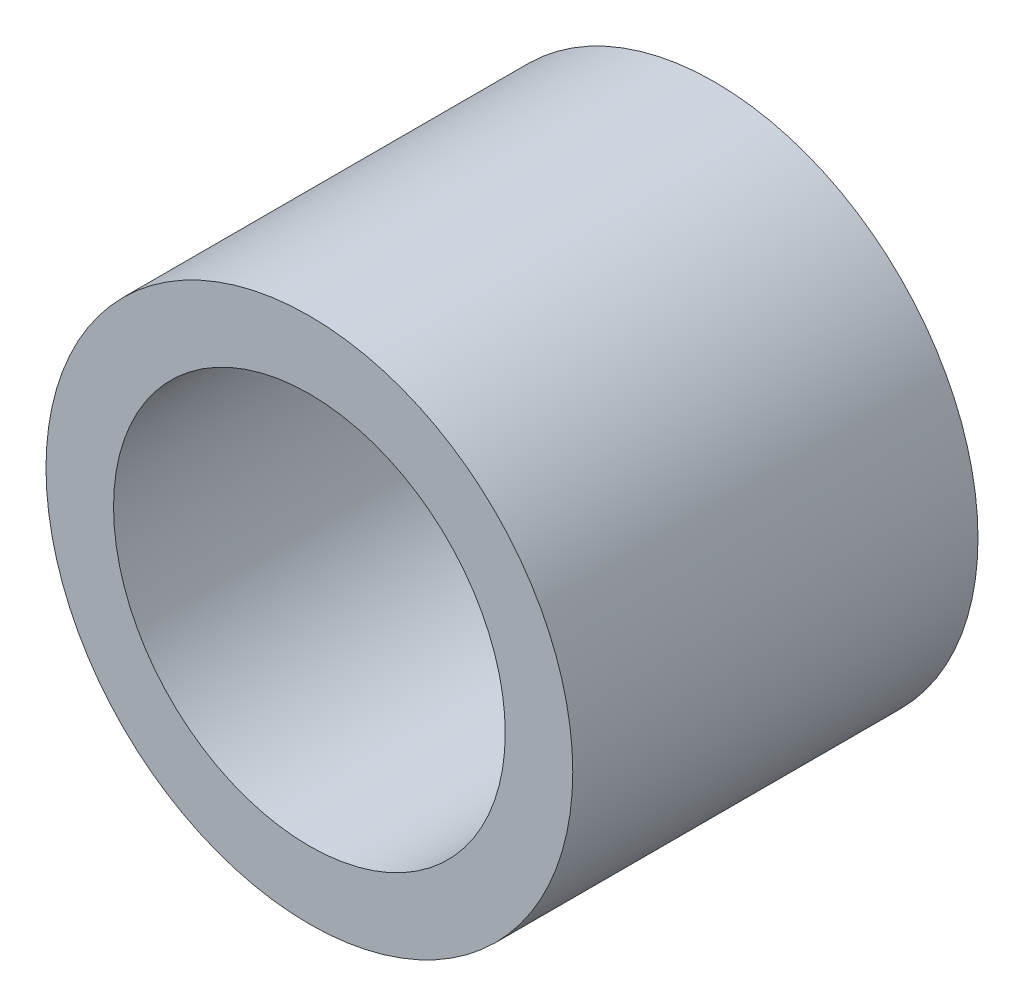
ISO-10303-21;
HEADER;
FILE_DESCRIPTION(('STEP AP214'),'2;1');
FILE_NAME('part.step','',(''),(''),'','','');
FILE_SCHEMA(('AUTOMOTIVE_DESIGN { 1 0 10303 214 1 1 1 1 }'));
ENDSEC;
DATA;
#1=APPLICATION_CONTEXT('core data for automotive mechanical design processes');
#2=APPLICATION_PROTOCOL_DEFINITION('international standard','automotive_design',2000,#1);
#3=PRODUCT_CONTEXT('',#1,'mechanical');
#4=PRODUCT('Part','Part','',(#3));
#5=PRODUCT_RELATED_PRODUCT_CATEGORY('part','',(#4));
#6=PRODUCT_DEFINITION_FORMATION('','',#4);
#7=PRODUCT_DEFINITION_CONTEXT('part definition',#1,'design');
#8=PRODUCT_DEFINITION('design','',#6,#7);
#9=PRODUCT_DEFINITION_SHAPE('','',#8);
#10=(LENGTH_UNIT() NAMED_UNIT(*) SI_UNIT(.MILLI.,.METRE.));
#11=(NAMED_UNIT(*) PLANE_ANGLE_UNIT() SI_UNIT($,.RADIAN.));
#12=(NAMED_UNIT(*) SI_UNIT($,.STERADIAN.) SOLID_ANGLE_UNIT());
#13=UNCERTAINTY_MEASURE_WITH_UNIT(LENGTH_MEASURE(1.E-05),#10,'distance_accuracy_value','');
#14=(GEOMETRIC_REPRESENTATION_CONTEXT(3) GLOBAL_UNCERTAINTY_ASSIGNED_CONTEXT((#13)) GLOBAL_UNIT_ASSIGNED_CONTEXT((#10,
#11,#12)) REPRESENTATION_CONTEXT('',''));
#15=CARTESIAN_POINT('',(0.,0.,0.));
#16=DIRECTION('',(0.,0.,1.));
#17=DIRECTION('',(1.,0.,0.));
#18=AXIS2_PLACEMENT_3D('',#15,#16,#17);
#19=CARTESIAN_POINT('',(0.,0.,6.));
#20=DIRECTION('',(0.,0.,1.));
#21=DIRECTION('',(1.,0.,0.));
#22=AXIS2_PLACEMENT_3D('',#19,#20,#21);
#23=PLANE('',#22);
#24=CARTESIAN_POINT('',(0.,0.,6.));
#25=DIRECTION('',(0.,0.,1.));
#26=DIRECTION('',(1.,0.,0.));
#27=AXIS2_PLACEMENT_3D('',#24,#25,#26);
#28=CIRCLE('',#27,3.9);
#29=CARTESIAN_POINT('',(3.9,0.,6.));
#30=VERTEX_POINT('',#29);
#31=EDGE_CURVE('E10',#30,#30,#28,.T.);
#32=ORIENTED_EDGE('',*,*,#31,.T.);
#33=EDGE_LOOP('',(#32));
#34=FACE_BOUND('',#33,.T.);
#35=CARTESIAN_POINT('',(0.,0.,6.));
#36=DIRECTION('',(0.,0.,1.));
#37=DIRECTION('',(1.,0.,0.));
#38=AXIS2_PLACEMENT_3D('',#35,#36,#37);
#39=CIRCLE('',#38,2.9);
#40=CARTESIAN_POINT('',(2.9,0.,6.));
#41=VERTEX_POINT('',#40);
#42=EDGE_CURVE('E56',#41,#41,#39,.T.);
#43=ORIENTED_EDGE('',*,*,#42,.F.);
#44=EDGE_LOOP('',(#43));
#45=FACE_BOUND('',#44,.T.);
#46=ADVANCED_FACE('F43',(#34,#45),#23,.T.);
#47=CARTESIAN_POINT('',(0.,0.,0.));
#48=DIRECTION('',(0.,0.,1.));
#49=DIRECTION('',(1.,0.,0.));
#50=AXIS2_PLACEMENT_3D('',#47,#48,#49);
#51=PLANE('',#50);
#52=CARTESIAN_POINT('',(0.,0.,0.));
#53=DIRECTION('',(0.,0.,1.));
#54=DIRECTION('',(1.,0.,0.));
#55=AXIS2_PLACEMENT_3D('',#52,#53,#54);
#56=CIRCLE('',#55,3.9);
#57=CARTESIAN_POINT('',(3.9,0.,0.));
#58=VERTEX_POINT('',#57);
#59=EDGE_CURVE('E47',#58,#58,#56,.T.);
#60=ORIENTED_EDGE('',*,*,#59,.F.);
#61=EDGE_LOOP('',(#60));
#62=FACE_BOUND('',#61,.T.);
#63=CARTESIAN_POINT('',(0.,0.,0.));
#64=DIRECTION('',(0.,0.,1.));
#65=DIRECTION('',(1.,0.,0.));
#66=AXIS2_PLACEMENT_3D('',#63,#64,#65);
#67=CIRCLE('',#66,2.9);
#68=CARTESIAN_POINT('',(2.9,0.,0.));
#69=VERTEX_POINT('',#68);
#70=EDGE_CURVE('E58',#69,#69,#67,.T.);
#71=ORIENTED_EDGE('',*,*,#70,.T.);
#72=EDGE_LOOP('',(#71));
#73=FACE_BOUND('',#72,.T.);
#74=ADVANCED_FACE('F70',(#62,#73),#51,.F.);
#75=CARTESIAN_POINT('',(0.,0.,6.));
#76=DIRECTION('',(0.,0.,-1.));
#77=DIRECTION('',(-1.,0.,0.));
#78=AXIS2_PLACEMENT_3D('',#75,#76,#77);
#79=CYLINDRICAL_SURFACE('',#78,3.9);
#80=ORIENTED_EDGE('',*,*,#31,.F.);
#81=EDGE_LOOP('',(#80));
#82=FACE_BOUND('',#81,.T.);
#83=ORIENTED_EDGE('',*,*,#59,.T.);
#84=EDGE_LOOP('',(#83));
#85=FACE_BOUND('',#84,.T.);
#86=ADVANCED_FACE('F45',(#82,#85),#79,.T.);
#87=CARTESIAN_POINT('',(0.,0.,6.));
#88=DIRECTION('',(0.,0.,-1.));
#89=DIRECTION('',(-1.,0.,0.));
#90=AXIS2_PLACEMENT_3D('',#87,#88,#89);
#91=CYLINDRICAL_SURFACE('',#90,2.9);
#92=ORIENTED_EDGE('',*,*,#42,.T.);
#93=EDGE_LOOP('',(#92));
#94=FACE_BOUND('',#93,.T.);
#95=ORIENTED_EDGE('',*,*,#70,.F.);
#96=EDGE_LOOP('',(#95));
#97=FACE_BOUND('',#96,.T.);
#98=ADVANCED_FACE('F66',(#94,#97),#91,.F.);
#99=CLOSED_SHELL('',(#46,#74,#86,#98));
#100=MANIFOLD_SOLID_BREP('B2',#99);
#101=ADVANCED_BREP_SHAPE_REPRESENTATION('',(#18,#100),#14);
#102=SHAPE_DEFINITION_REPRESENTATION(#9,#101);
ENDSEC;
END-ISO-10303-21;
